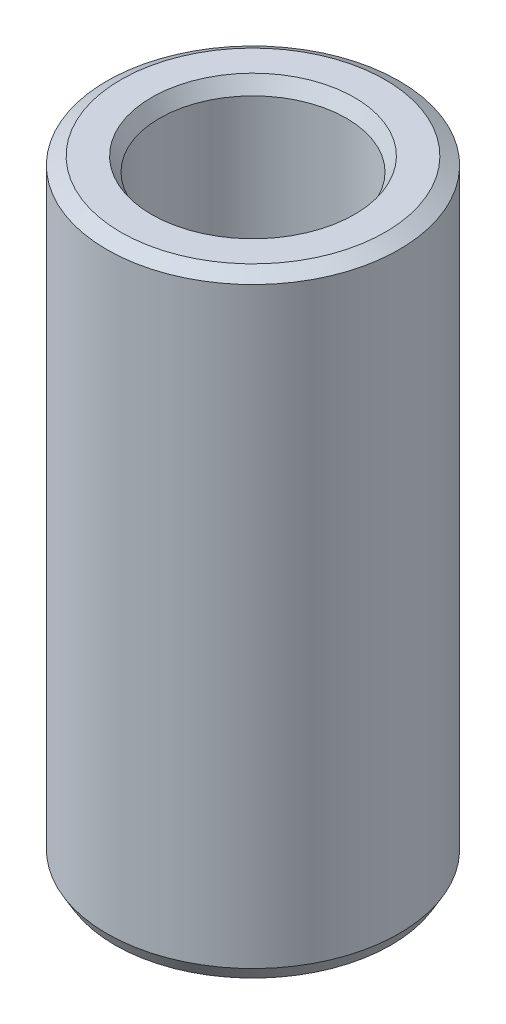
ISO-10303-21;
HEADER;
FILE_DESCRIPTION(('STEP AP214'),'2;1');
FILE_NAME('part.step','',(''),(''),'','','');
FILE_SCHEMA(('AUTOMOTIVE_DESIGN { 1 0 10303 214 1 1 1 1 }'));
ENDSEC;
DATA;
#1=APPLICATION_CONTEXT('core data for automotive mechanical design processes');
#2=APPLICATION_PROTOCOL_DEFINITION('international standard','automotive_design',2000,#1);
#3=PRODUCT_CONTEXT('',#1,'mechanical');
#4=PRODUCT('Part','Part','',(#3));
#5=PRODUCT_RELATED_PRODUCT_CATEGORY('part','',(#4));
#6=PRODUCT_DEFINITION_FORMATION('','',#4);
#7=PRODUCT_DEFINITION_CONTEXT('part definition',#1,'design');
#8=PRODUCT_DEFINITION('design','',#6,#7);
#9=PRODUCT_DEFINITION_SHAPE('','',#8);
#10=(LENGTH_UNIT() NAMED_UNIT(*) SI_UNIT(.MILLI.,.METRE.));
#11=(NAMED_UNIT(*) PLANE_ANGLE_UNIT() SI_UNIT($,.RADIAN.));
#12=(NAMED_UNIT(*) SI_UNIT($,.STERADIAN.) SOLID_ANGLE_UNIT());
#13=UNCERTAINTY_MEASURE_WITH_UNIT(LENGTH_MEASURE(1.E-05),#10,'distance_accuracy_value','');
#14=(GEOMETRIC_REPRESENTATION_CONTEXT(3) GLOBAL_UNCERTAINTY_ASSIGNED_CONTEXT((#13)) GLOBAL_UNIT_ASSIGNED_CONTEXT((#10,
#11,#12)) REPRESENTATION_CONTEXT('',''));
#15=CARTESIAN_POINT('',(0.,0.,0.));
#16=DIRECTION('',(0.,0.,1.));
#17=DIRECTION('',(1.,0.,0.));
#18=AXIS2_PLACEMENT_3D('',#15,#16,#17);
#19=CARTESIAN_POINT('',(0.,94.6038413130513,0.));
#20=DIRECTION('',(0.,-1.,0.));
#21=DIRECTION('',(0.,0.,-1.));
#22=AXIS2_PLACEMENT_3D('',#19,#20,#21);
#23=CYLINDRICAL_SURFACE('',#22,22.5);
#24=CARTESIAN_POINT('',(0.,2.14842806966214,0.));
#25=DIRECTION('',(0.,1.,0.));
#26=DIRECTION('',(0.,0.,1.));
#27=AXIS2_PLACEMENT_3D('',#24,#25,#26);
#28=CIRCLE('',#27,22.5);
#29=CARTESIAN_POINT('',(0.,2.14842806966214,22.5));
#30=VERTEX_POINT('',#29);
#31=EDGE_CURVE('E10',#30,#30,#28,.T.);
#32=ORIENTED_EDGE('',*,*,#31,.T.);
#33=EDGE_LOOP('',(#32));
#34=FACE_BOUND('',#33,.T.);
#35=CARTESIAN_POINT('',(0.,93.3634457886973,0.));
#36=DIRECTION('',(0.,1.,0.));
#37=DIRECTION('',(0.,0.,1.));
#38=AXIS2_PLACEMENT_3D('',#35,#36,#37);
#39=CIRCLE('',#38,22.5);
#40=CARTESIAN_POINT('',(0.,93.3634457886973,22.5));
#41=VERTEX_POINT('',#40);
#42=EDGE_CURVE('E50',#41,#41,#39,.F.);
#43=ORIENTED_EDGE('',*,*,#42,.T.);
#44=EDGE_LOOP('',(#43));
#45=FACE_BOUND('',#44,.T.);
#46=ADVANCED_FACE('F39',(#34,#45),#23,.T.);
#47=CARTESIAN_POINT('',(0.,94.6038413130513,0.));
#48=DIRECTION('',(0.,1.,0.));
#49=DIRECTION('',(0.,0.,1.));
#50=AXIS2_PLACEMENT_3D('',#47,#48,#49);
#51=PLANE('',#50);
#52=CARTESIAN_POINT('',(0.,94.6038413130513,0.));
#53=DIRECTION('',(0.,1.,0.));
#54=DIRECTION('',(0.,0.,1.));
#55=AXIS2_PLACEMENT_3D('',#52,#53,#54);
#56=CIRCLE('',#55,15.6189513889918);
#57=CARTESIAN_POINT('',(0.,94.6038413130513,15.6189513889918));
#58=VERTEX_POINT('',#57);
#59=EDGE_CURVE('E58',#58,#58,#56,.F.);
#60=ORIENTED_EDGE('',*,*,#59,.T.);
#61=EDGE_LOOP('',(#60));
#62=FACE_BOUND('',#61,.T.);
#63=CARTESIAN_POINT('',(0.,94.6038413130513,0.));
#64=DIRECTION('',(0.,1.,0.));
#65=DIRECTION('',(0.,0.,1.));
#66=AXIS2_PLACEMENT_3D('',#63,#64,#65);
#67=CIRCLE('',#66,20.3515719303378);
#68=CARTESIAN_POINT('',(0.,94.6038413130513,20.3515719303378));
#69=VERTEX_POINT('',#68);
#70=EDGE_CURVE('E61',#69,#69,#67,.T.);
#71=ORIENTED_EDGE('',*,*,#70,.T.);
#72=EDGE_LOOP('',(#71));
#73=FACE_BOUND('',#72,.T.);
#74=ADVANCED_FACE('F88',(#62,#73),#51,.T.);
#75=CARTESIAN_POINT('',(0.,0.,0.));
#76=DIRECTION('',(0.,1.,0.));
#77=DIRECTION('',(0.,0.,1.));
#78=AXIS2_PLACEMENT_3D('',#75,#76,#77);
#79=PLANE('',#78);
#80=CARTESIAN_POINT('',(0.,0.,0.));
#81=DIRECTION('',(0.,1.,0.));
#82=DIRECTION('',(0.,0.,1.));
#83=AXIS2_PLACEMENT_3D('',#80,#81,#82);
#84=CIRCLE('',#83,16.5269839343);
#85=CARTESIAN_POINT('',(0.,0.,16.5269839343));
#86=VERTEX_POINT('',#85);
#87=EDGE_CURVE('E51',#86,#86,#84,.T.);
#88=ORIENTED_EDGE('',*,*,#87,.T.);
#89=EDGE_LOOP('',(#88));
#90=FACE_BOUND('',#89,.T.);
#91=CARTESIAN_POINT('',(0.,0.,0.));
#92=DIRECTION('',(0.,1.,0.));
#93=DIRECTION('',(0.,0.,1.));
#94=AXIS2_PLACEMENT_3D('',#91,#92,#93);
#95=CIRCLE('',#94,21.259604475646);
#96=CARTESIAN_POINT('',(0.,0.,21.259604475646));
#97=VERTEX_POINT('',#96);
#98=EDGE_CURVE('E54',#97,#97,#95,.F.);
#99=ORIENTED_EDGE('',*,*,#98,.T.);
#100=EDGE_LOOP('',(#99));
#101=FACE_BOUND('',#100,.T.);
#102=ADVANCED_FACE('F83',(#90,#101),#79,.F.);
#103=CARTESIAN_POINT('',(0.,94.6038413130513,0.));
#104=DIRECTION('',(0.,-1.,0.));
#105=DIRECTION('',(0.,0.,-1.));
#106=AXIS2_PLACEMENT_3D('',#103,#104,#105);
#107=CYLINDRICAL_SURFACE('',#106,14.3785558646378);
#108=CARTESIAN_POINT('',(0.,92.4554132433891,0.));
#109=DIRECTION('',(0.,1.,0.));
#110=DIRECTION('',(0.,0.,1.));
#111=AXIS2_PLACEMENT_3D('',#108,#109,#110);
#112=CIRCLE('',#111,14.3785558646378);
#113=CARTESIAN_POINT('',(0.,92.4554132433891,14.3785558646378));
#114=VERTEX_POINT('',#113);
#115=EDGE_CURVE('E67',#114,#114,#112,.T.);
#116=ORIENTED_EDGE('',*,*,#115,.T.);
#117=EDGE_LOOP('',(#116));
#118=FACE_BOUND('',#117,.T.);
#119=CARTESIAN_POINT('',(0.,1.24039552435402,0.));
#120=DIRECTION('',(0.,1.,0.));
#121=DIRECTION('',(0.,0.,1.));
#122=AXIS2_PLACEMENT_3D('',#119,#120,#121);
#123=CIRCLE('',#122,14.3785558646378);
#124=CARTESIAN_POINT('',(0.,1.24039552435402,14.3785558646378));
#125=VERTEX_POINT('',#124);
#126=EDGE_CURVE('E69',#125,#125,#123,.F.);
#127=ORIENTED_EDGE('',*,*,#126,.T.);
#128=EDGE_LOOP('',(#127));
#129=FACE_BOUND('',#128,.T.);
#130=ADVANCED_FACE('F71',(#118,#129),#107,.F.);
#131=CARTESIAN_POINT('',(0.,92.4554132433891,0.));
#132=DIRECTION('',(0.,1.,0.));
#133=DIRECTION('',(0.,0.,1.));
#134=AXIS2_PLACEMENT_3D('',#131,#132,#133);
#135=CONICAL_SURFACE('',#134,14.3785558646378,0.523598775598295);
#136=ORIENTED_EDGE('',*,*,#59,.F.);
#137=EDGE_LOOP('',(#136));
#138=FACE_BOUND('',#137,.T.);
#139=ORIENTED_EDGE('',*,*,#115,.F.);
#140=EDGE_LOOP('',(#139));
#141=FACE_BOUND('',#140,.T.);
#142=ADVANCED_FACE('F77',(#138,#141),#135,.F.);
#143=CARTESIAN_POINT('',(0.,0.,0.));
#144=DIRECTION('',(0.,-1.,0.));
#145=DIRECTION('',(0.,0.,-1.));
#146=AXIS2_PLACEMENT_3D('',#143,#144,#145);
#147=CONICAL_SURFACE('',#146,16.5269839343,1.0471975511966);
#148=ORIENTED_EDGE('',*,*,#126,.F.);
#149=EDGE_LOOP('',(#148));
#150=FACE_BOUND('',#149,.T.);
#151=ORIENTED_EDGE('',*,*,#87,.F.);
#152=EDGE_LOOP('',(#151));
#153=FACE_BOUND('',#152,.T.);
#154=ADVANCED_FACE('F73',(#150,#153),#147,.F.);
#155=CARTESIAN_POINT('',(0.,2.14842806966214,0.));
#156=DIRECTION('',(0.,1.,0.));
#157=DIRECTION('',(0.,0.,1.));
#158=AXIS2_PLACEMENT_3D('',#155,#156,#157);
#159=CONICAL_SURFACE('',#158,22.5,0.523598775598303);
#160=ORIENTED_EDGE('',*,*,#98,.F.);
#161=EDGE_LOOP('',(#160));
#162=FACE_BOUND('',#161,.T.);
#163=ORIENTED_EDGE('',*,*,#31,.F.);
#164=EDGE_LOOP('',(#163));
#165=FACE_BOUND('',#164,.T.);
#166=ADVANCED_FACE('F76',(#162,#165),#159,.T.);
#167=CARTESIAN_POINT('',(0.,94.6038413130513,0.));
#168=DIRECTION('',(0.,-1.,0.));
#169=DIRECTION('',(0.,0.,-1.));
#170=AXIS2_PLACEMENT_3D('',#167,#168,#169);
#171=CONICAL_SURFACE('',#170,20.3515719303378,1.0471975511966);
#172=ORIENTED_EDGE('',*,*,#42,.F.);
#173=EDGE_LOOP('',(#172));
#174=FACE_BOUND('',#173,.T.);
#175=ORIENTED_EDGE('',*,*,#70,.F.);
#176=EDGE_LOOP('',(#175));
#177=FACE_BOUND('',#176,.T.);
#178=ADVANCED_FACE('F45',(#174,#177),#171,.T.);
#179=CLOSED_SHELL('',(#46,#74,#102,#130,#142,#154,#166,#178));
#180=MANIFOLD_SOLID_BREP('B2',#179);
#181=ADVANCED_BREP_SHAPE_REPRESENTATION('',(#18,#180),#14);
#182=SHAPE_DEFINITION_REPRESENTATION(#9,#181);
ENDSEC;
END-ISO-10303-21;
